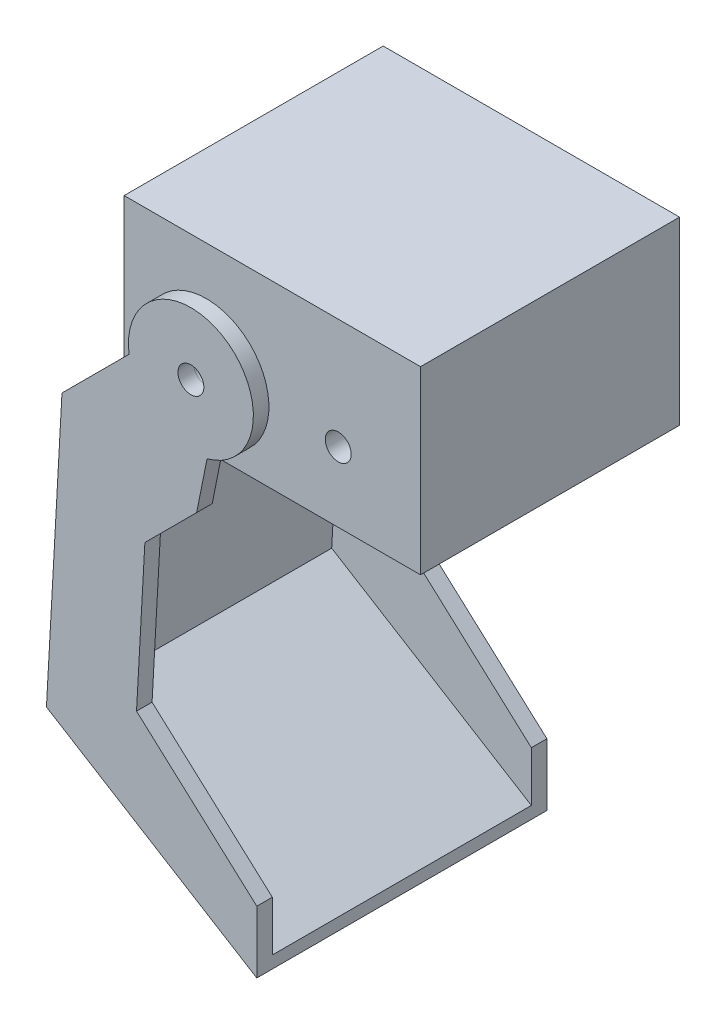
ISO-10303-21;
HEADER;
FILE_DESCRIPTION(('STEP AP214'),'2;1');
FILE_NAME('part.step','',(''),(''),'','','');
FILE_SCHEMA(('AUTOMOTIVE_DESIGN { 1 0 10303 214 1 1 1 1 }'));
ENDSEC;
DATA;
#1=APPLICATION_CONTEXT('core data for automotive mechanical design processes');
#2=APPLICATION_PROTOCOL_DEFINITION('international standard','automotive_design',2000,#1);
#3=PRODUCT_CONTEXT('',#1,'mechanical');
#4=PRODUCT('Part','Part','',(#3));
#5=PRODUCT_RELATED_PRODUCT_CATEGORY('part','',(#4));
#6=PRODUCT_DEFINITION_FORMATION('','',#4);
#7=PRODUCT_DEFINITION_CONTEXT('part definition',#1,'design');
#8=PRODUCT_DEFINITION('design','',#6,#7);
#9=PRODUCT_DEFINITION_SHAPE('','',#8);
#10=(LENGTH_UNIT() NAMED_UNIT(*) SI_UNIT(.MILLI.,.METRE.));
#11=(NAMED_UNIT(*) PLANE_ANGLE_UNIT() SI_UNIT($,.RADIAN.));
#12=(NAMED_UNIT(*) SI_UNIT($,.STERADIAN.) SOLID_ANGLE_UNIT());
#13=UNCERTAINTY_MEASURE_WITH_UNIT(LENGTH_MEASURE(1.E-05),#10,'distance_accuracy_value','');
#14=(GEOMETRIC_REPRESENTATION_CONTEXT(3) GLOBAL_UNCERTAINTY_ASSIGNED_CONTEXT((#13)) GLOBAL_UNIT_ASSIGNED_CONTEXT((#10,
#11,#12)) REPRESENTATION_CONTEXT('',''));
#15=CARTESIAN_POINT('',(0.,0.,0.));
#16=DIRECTION('',(0.,0.,1.));
#17=DIRECTION('',(1.,0.,0.));
#18=AXIS2_PLACEMENT_3D('',#15,#16,#17);
#19=CARTESIAN_POINT('',(-12.72,13.45,25.));
#20=DIRECTION('',(0.,0.,1.));
#21=DIRECTION('',(1.,0.,0.));
#22=AXIS2_PLACEMENT_3D('',#19,#20,#21);
#23=PLANE('',#22);
#24=CARTESIAN_POINT('',(-12.72,13.45,25.));
#25=DIRECTION('',(0.,0.,1.));
#26=DIRECTION('',(1.,0.,0.));
#27=AXIS2_PLACEMENT_3D('',#24,#25,#26);
#28=CIRCLE('',#27,2.5);
#29=CARTESIAN_POINT('',(-10.22,13.45,25.));
#30=VERTEX_POINT('',#29);
#31=EDGE_CURVE('E281',#30,#30,#28,.T.);
#32=ORIENTED_EDGE('',*,*,#31,.T.);
#33=EDGE_LOOP('',(#32));
#34=FACE_BOUND('',#33,.T.);
#35=DIRECTION('',(0.,1.,0.));
#36=VECTOR('',#35,1.);
#37=CARTESIAN_POINT('',(0.,-68.2,25.));
#38=LINE('',#37,#36);
#39=CARTESIAN_POINT('',(0.,-77.8513226083747,25.));
#40=VERTEX_POINT('',#39);
#41=CARTESIAN_POINT('',(0.,-68.2,25.));
#42=VERTEX_POINT('',#41);
#43=EDGE_CURVE('E310',#40,#42,#38,.T.);
#44=ORIENTED_EDGE('',*,*,#43,.F.);
#45=DIRECTION('',(0.851543088519277,-0.524284625365889,0.));
#46=VECTOR('',#45,1.);
#47=CARTESIAN_POINT('',(-38.5419985832739,-54.12148725357,25.));
#48=LINE('',#47,#46);
#49=CARTESIAN_POINT('',(-38.5419985832739,-54.12148725357,25.));
#50=VERTEX_POINT('',#49);
#51=EDGE_CURVE('E65',#50,#40,#48,.T.);
#52=ORIENTED_EDGE('',*,*,#51,.F.);
#53=DIRECTION('',(-0.0554700196225231,-0.998460353205412,0.));
#54=VECTOR('',#53,1.);
#55=CARTESIAN_POINT('',(-35.7190193328342,-3.30786074565586,25.));
#56=LINE('',#55,#54);
#57=CARTESIAN_POINT('',(-35.7190193328342,-3.30786074565586,25.));
#58=VERTEX_POINT('',#57);
#59=EDGE_CURVE('E269',#58,#50,#56,.T.);
#60=ORIENTED_EDGE('',*,*,#59,.F.);
#61=DIRECTION('',(0.666794859469826,-0.745241313525099,0.));
#62=VECTOR('',#61,1.);
#63=CARTESIAN_POINT('',(-37.605,-1.2,25.));
#64=LINE('',#63,#62);
#65=CARTESIAN_POINT('',(-37.605,-1.2,25.));
#66=VERTEX_POINT('',#65);
#67=EDGE_CURVE('E266',#66,#58,#64,.T.);
#68=ORIENTED_EDGE('',*,*,#67,.F.);
#69=DIRECTION('',(-0.707106781186547,-0.707106781186547,0.));
#70=VECTOR('',#69,1.);
#71=CARTESIAN_POINT('',(-37.605,-1.2,25.));
#72=LINE('',#71,#70);
#73=CARTESIAN_POINT('',(-24.6583545102502,11.7466454897498,25.));
#74=VERTEX_POINT('',#73);
#75=EDGE_CURVE('E285',#74,#66,#72,.T.);
#76=ORIENTED_EDGE('',*,*,#75,.F.);
#77=CARTESIAN_POINT('',(-12.72,13.45,25.));
#78=DIRECTION('',(0.,0.,1.));
#79=DIRECTION('',(1.,0.,0.));
#80=AXIS2_PLACEMENT_3D('',#77,#78,#79);
#81=CIRCLE('',#80,12.0592588909933);
#82=CARTESIAN_POINT('',(-9.60499999999999,1.8,25.));
#83=VERTEX_POINT('',#82);
#84=EDGE_CURVE('E291',#83,#74,#81,.T.);
#85=ORIENTED_EDGE('',*,*,#84,.F.);
#86=DIRECTION('',(0.196116135138184,0.98058067569092,0.));
#87=VECTOR('',#86,1.);
#88=CARTESIAN_POINT('',(-9.60499999999999,1.8,25.));
#89=LINE('',#88,#87);
#90=CARTESIAN_POINT('',(-11.605,-8.2,25.));
#91=VERTEX_POINT('',#90);
#92=EDGE_CURVE('E318',#91,#83,#89,.T.);
#93=ORIENTED_EDGE('',*,*,#92,.F.);
#94=DIRECTION('',(0.707106781186548,0.707106781186548,0.));
#95=VECTOR('',#94,1.);
#96=CARTESIAN_POINT('',(-11.605,-8.2,25.));
#97=LINE('',#96,#95);
#98=CARTESIAN_POINT('',(-21.605,-18.2,25.));
#99=VERTEX_POINT('',#98);
#100=EDGE_CURVE('E316',#99,#91,#97,.T.);
#101=ORIENTED_EDGE('',*,*,#100,.F.);
#102=DIRECTION('',(0.0554700196225228,0.998460353205412,0.));
#103=VECTOR('',#102,1.);
#104=CARTESIAN_POINT('',(-21.605,-18.2,25.));
#105=LINE('',#104,#103);
#106=CARTESIAN_POINT('',(-23.2161111111111,-47.2,25.));
#107=VERTEX_POINT('',#106);
#108=EDGE_CURVE('E314',#107,#99,#105,.T.);
#109=ORIENTED_EDGE('',*,*,#108,.F.);
#110=DIRECTION('',(-0.741616076439865,0.670824563627436,0.));
#111=VECTOR('',#110,1.);
#112=CARTESIAN_POINT('',(-23.2161111111111,-47.2,25.));
#113=LINE('',#112,#111);
#114=EDGE_CURVE('E312',#42,#107,#113,.T.);
#115=ORIENTED_EDGE('',*,*,#114,.F.);
#116=EDGE_LOOP('',(#44,#52,#60,#68,#76,#85,#93,#101,#109,#115));
#117=FACE_BOUND('',#116,.T.);
#118=ADVANCED_FACE('F50',(#34,#117),#23,.F.);
#119=CARTESIAN_POINT('',(-12.72,13.45,-25.));
#120=DIRECTION('',(0.,0.,-1.));
#121=DIRECTION('',(1.,0.,0.));
#122=AXIS2_PLACEMENT_3D('',#119,#120,#121);
#123=PLANE('',#122);
#124=CARTESIAN_POINT('',(-12.72,13.45,-25.));
#125=DIRECTION('',(0.,0.,1.));
#126=DIRECTION('',(1.,0.,0.));
#127=AXIS2_PLACEMENT_3D('',#124,#125,#126);
#128=CIRCLE('',#127,2.5);
#129=CARTESIAN_POINT('',(-10.22,13.45,-25.));
#130=VERTEX_POINT('',#129);
#131=EDGE_CURVE('E188',#130,#130,#128,.T.);
#132=ORIENTED_EDGE('',*,*,#131,.F.);
#133=EDGE_LOOP('',(#132));
#134=FACE_BOUND('',#133,.T.);
#135=DIRECTION('',(0.851543088519277,-0.524284625365889,0.));
#136=VECTOR('',#135,1.);
#137=CARTESIAN_POINT('',(-38.5419985832739,-54.12148725357,-25.));
#138=LINE('',#137,#136);
#139=CARTESIAN_POINT('',(-38.5419985832739,-54.12148725357,-25.));
#140=VERTEX_POINT('',#139);
#141=CARTESIAN_POINT('',(0.,-77.8513226083747,-25.));
#142=VERTEX_POINT('',#141);
#143=EDGE_CURVE('E179',#140,#142,#138,.T.);
#144=ORIENTED_EDGE('',*,*,#143,.T.);
#145=DIRECTION('',(0.,1.,0.));
#146=VECTOR('',#145,1.);
#147=CARTESIAN_POINT('',(0.,-68.2,-25.));
#148=LINE('',#147,#146);
#149=CARTESIAN_POINT('',(0.,-68.2,-25.));
#150=VERTEX_POINT('',#149);
#151=EDGE_CURVE('E183',#142,#150,#148,.T.);
#152=ORIENTED_EDGE('',*,*,#151,.T.);
#153=DIRECTION('',(-0.741616076439865,0.670824563627436,0.));
#154=VECTOR('',#153,1.);
#155=CARTESIAN_POINT('',(-23.2161111111111,-47.2,-25.));
#156=LINE('',#155,#154);
#157=CARTESIAN_POINT('',(-23.2161111111111,-47.2,-25.));
#158=VERTEX_POINT('',#157);
#159=EDGE_CURVE('E198',#150,#158,#156,.T.);
#160=ORIENTED_EDGE('',*,*,#159,.T.);
#161=DIRECTION('',(0.0554700196225228,0.998460353205412,0.));
#162=VECTOR('',#161,1.);
#163=CARTESIAN_POINT('',(-21.605,-18.2,-25.));
#164=LINE('',#163,#162);
#165=CARTESIAN_POINT('',(-21.605,-18.2,-25.));
#166=VERTEX_POINT('',#165);
#167=EDGE_CURVE('E220',#158,#166,#164,.T.);
#168=ORIENTED_EDGE('',*,*,#167,.T.);
#169=DIRECTION('',(0.707106781186548,0.707106781186548,0.));
#170=VECTOR('',#169,1.);
#171=CARTESIAN_POINT('',(-11.605,-8.2,-25.));
#172=LINE('',#171,#170);
#173=CARTESIAN_POINT('',(-11.605,-8.2,-25.));
#174=VERTEX_POINT('',#173);
#175=EDGE_CURVE('E217',#166,#174,#172,.T.);
#176=ORIENTED_EDGE('',*,*,#175,.T.);
#177=DIRECTION('',(0.196116135138184,0.98058067569092,0.));
#178=VECTOR('',#177,1.);
#179=CARTESIAN_POINT('',(-9.60499999999999,1.8,-25.));
#180=LINE('',#179,#178);
#181=CARTESIAN_POINT('',(-9.60499999999999,1.8,-25.));
#182=VERTEX_POINT('',#181);
#183=EDGE_CURVE('E214',#174,#182,#180,.T.);
#184=ORIENTED_EDGE('',*,*,#183,.T.);
#185=CARTESIAN_POINT('',(-12.72,13.45,-25.));
#186=DIRECTION('',(0.,0.,1.));
#187=DIRECTION('',(1.,0.,0.));
#188=AXIS2_PLACEMENT_3D('',#185,#186,#187);
#189=CIRCLE('',#188,12.0592588909933);
#190=CARTESIAN_POINT('',(-24.6583545102502,11.7466454897498,-25.));
#191=VERTEX_POINT('',#190);
#192=EDGE_CURVE('E211',#182,#191,#189,.T.);
#193=ORIENTED_EDGE('',*,*,#192,.T.);
#194=DIRECTION('',(-0.707106781186547,-0.707106781186547,0.));
#195=VECTOR('',#194,1.);
#196=CARTESIAN_POINT('',(-37.605,-1.2,-25.));
#197=LINE('',#196,#195);
#198=CARTESIAN_POINT('',(-37.605,-1.2,-25.));
#199=VERTEX_POINT('',#198);
#200=EDGE_CURVE('E208',#191,#199,#197,.T.);
#201=ORIENTED_EDGE('',*,*,#200,.T.);
#202=DIRECTION('',(0.666794859469826,-0.745241313525099,0.));
#203=VECTOR('',#202,1.);
#204=CARTESIAN_POINT('',(-37.605,-1.2,-25.));
#205=LINE('',#204,#203);
#206=CARTESIAN_POINT('',(-35.7190193328342,-3.30786074565586,-25.));
#207=VERTEX_POINT('',#206);
#208=EDGE_CURVE('E206',#199,#207,#205,.T.);
#209=ORIENTED_EDGE('',*,*,#208,.T.);
#210=DIRECTION('',(-0.0554700196225231,-0.998460353205412,0.));
#211=VECTOR('',#210,1.);
#212=CARTESIAN_POINT('',(-35.7190193328342,-3.30786074565586,-25.));
#213=LINE('',#212,#211);
#214=EDGE_CURVE('E187',#207,#140,#213,.T.);
#215=ORIENTED_EDGE('',*,*,#214,.T.);
#216=EDGE_LOOP('',(#144,#152,#160,#168,#176,#184,#193,#201,#209,#215));
#217=FACE_BOUND('',#216,.T.);
#218=ADVANCED_FACE('F181',(#134,#217),#123,.F.);
#219=CARTESIAN_POINT('',(-12.72,13.45,28.));
#220=DIRECTION('',(0.,0.,1.));
#221=DIRECTION('',(1.,0.,0.));
#222=AXIS2_PLACEMENT_3D('',#219,#220,#221);
#223=PLANE('',#222);
#224=DIRECTION('',(-0.707106781186548,-0.707106781186548,0.));
#225=VECTOR('',#224,1.);
#226=CARTESIAN_POINT('',(-28.605,7.8,28.));
#227=LINE('',#226,#225);
#228=CARTESIAN_POINT('',(-24.6583545102502,11.7466454897498,28.));
#229=VERTEX_POINT('',#228);
#230=CARTESIAN_POINT('',(-37.605,-1.2,28.));
#231=VERTEX_POINT('',#230);
#232=EDGE_CURVE('E288',#229,#231,#227,.T.);
#233=ORIENTED_EDGE('',*,*,#232,.T.);
#234=DIRECTION('',(-0.055470019622523,-0.998460353205412,0.));
#235=VECTOR('',#234,1.);
#236=CARTESIAN_POINT('',(-40.605,-55.2,28.));
#237=LINE('',#236,#235);
#238=CARTESIAN_POINT('',(-40.605,-55.2,28.));
#239=VERTEX_POINT('',#238);
#240=EDGE_CURVE('E290',#231,#239,#237,.T.);
#241=ORIENTED_EDGE('',*,*,#240,.T.);
#242=DIRECTION('',(0.851543088519277,-0.524284625365889,0.));
#243=VECTOR('',#242,1.);
#244=CARTESIAN_POINT('',(0.,-80.2,28.));
#245=LINE('',#244,#243);
#246=CARTESIAN_POINT('',(0.,-80.2,28.));
#247=VERTEX_POINT('',#246);
#248=EDGE_CURVE('E293',#239,#247,#245,.T.);
#249=ORIENTED_EDGE('',*,*,#248,.T.);
#250=DIRECTION('',(0.,1.,0.));
#251=VECTOR('',#250,1.);
#252=CARTESIAN_POINT('',(0.,-68.2,28.));
#253=LINE('',#252,#251);
#254=CARTESIAN_POINT('',(0.,-68.2,28.));
#255=VERTEX_POINT('',#254);
#256=EDGE_CURVE('E295',#247,#255,#253,.T.);
#257=ORIENTED_EDGE('',*,*,#256,.T.);
#258=DIRECTION('',(-0.741616076439865,0.670824563627436,0.));
#259=VECTOR('',#258,1.);
#260=CARTESIAN_POINT('',(-23.2161111111111,-47.2,28.));
#261=LINE('',#260,#259);
#262=CARTESIAN_POINT('',(-23.2161111111111,-47.2,28.));
#263=VERTEX_POINT('',#262);
#264=EDGE_CURVE('E297',#255,#263,#261,.T.);
#265=ORIENTED_EDGE('',*,*,#264,.T.);
#266=DIRECTION('',(0.0554700196225228,0.998460353205412,0.));
#267=VECTOR('',#266,1.);
#268=CARTESIAN_POINT('',(-21.605,-18.2,28.));
#269=LINE('',#268,#267);
#270=CARTESIAN_POINT('',(-21.605,-18.2,28.));
#271=VERTEX_POINT('',#270);
#272=EDGE_CURVE('E299',#263,#271,#269,.T.);
#273=ORIENTED_EDGE('',*,*,#272,.T.);
#274=DIRECTION('',(0.707106781186548,0.707106781186548,0.));
#275=VECTOR('',#274,1.);
#276=CARTESIAN_POINT('',(-11.605,-8.2,28.));
#277=LINE('',#276,#275);
#278=CARTESIAN_POINT('',(-11.605,-8.2,28.));
#279=VERTEX_POINT('',#278);
#280=EDGE_CURVE('E301',#271,#279,#277,.T.);
#281=ORIENTED_EDGE('',*,*,#280,.T.);
#282=DIRECTION('',(0.196116135138184,0.98058067569092,0.));
#283=VECTOR('',#282,1.);
#284=CARTESIAN_POINT('',(-9.60499999999999,1.8,28.));
#285=LINE('',#284,#283);
#286=CARTESIAN_POINT('',(-9.60499999999999,1.8,28.));
#287=VERTEX_POINT('',#286);
#288=EDGE_CURVE('E303',#279,#287,#285,.T.);
#289=ORIENTED_EDGE('',*,*,#288,.T.);
#290=CARTESIAN_POINT('',(-12.72,13.45,28.));
#291=DIRECTION('',(0.,0.,1.));
#292=DIRECTION('',(1.,0.,0.));
#293=AXIS2_PLACEMENT_3D('',#290,#291,#292);
#294=CIRCLE('',#293,12.0592588909933);
#295=EDGE_CURVE('E305',#287,#229,#294,.T.);
#296=ORIENTED_EDGE('',*,*,#295,.T.);
#297=EDGE_LOOP('',(#233,#241,#249,#257,#265,#273,#281,#289,#296));
#298=FACE_BOUND('',#297,.T.);
#299=CARTESIAN_POINT('',(-12.72,13.45,28.));
#300=DIRECTION('',(0.,0.,1.));
#301=DIRECTION('',(1.,0.,0.));
#302=AXIS2_PLACEMENT_3D('',#299,#300,#301);
#303=CIRCLE('',#302,2.5);
#304=CARTESIAN_POINT('',(-10.22,13.45,28.));
#305=VERTEX_POINT('',#304);
#306=EDGE_CURVE('E282',#305,#305,#303,.T.);
#307=ORIENTED_EDGE('',*,*,#306,.F.);
#308=EDGE_LOOP('',(#307));
#309=FACE_BOUND('',#308,.T.);
#310=ADVANCED_FACE('F361',(#298,#309),#223,.T.);
#311=CARTESIAN_POINT('',(-37.605,-1.2,28.));
#312=DIRECTION('',(0.707106781186548,-0.707106781186548,0.));
#313=DIRECTION('',(0.707106781186548,0.707106781186548,0.));
#314=AXIS2_PLACEMENT_3D('',#311,#312,#313);
#315=PLANE('',#314);
#316=ORIENTED_EDGE('',*,*,#75,.T.);
#317=DIRECTION('',(0.,0.,-1.));
#318=VECTOR('',#317,1.);
#319=CARTESIAN_POINT('',(-37.605,-1.2,28.));
#320=LINE('',#319,#318);
#321=EDGE_CURVE('E12',#231,#66,#320,.T.);
#322=ORIENTED_EDGE('',*,*,#321,.F.);
#323=ORIENTED_EDGE('',*,*,#232,.F.);
#324=DIRECTION('',(0.,0.,-1.));
#325=VECTOR('',#324,1.);
#326=CARTESIAN_POINT('',(-24.6583545102502,11.7466454897498,28.));
#327=LINE('',#326,#325);
#328=EDGE_CURVE('E307',#229,#74,#327,.T.);
#329=ORIENTED_EDGE('',*,*,#328,.T.);
#330=EDGE_LOOP('',(#316,#322,#323,#329));
#331=FACE_BOUND('',#330,.T.);
#332=ADVANCED_FACE('F52',(#331),#315,.F.);
#333=CARTESIAN_POINT('',(-40.605,-55.2,28.));
#334=DIRECTION('',(0.998460353205412,-0.055470019622523,0.));
#335=DIRECTION('',(0.055470019622523,0.998460353205413,0.));
#336=AXIS2_PLACEMENT_3D('',#333,#334,#335);
#337=PLANE('',#336);
#338=ORIENTED_EDGE('',*,*,#321,.T.);
#339=DIRECTION('',(0.,0.,1.));
#340=VECTOR('',#339,1.);
#341=CARTESIAN_POINT('',(-37.605,-1.2,-71.9292288820542));
#342=LINE('',#341,#340);
#343=EDGE_CURVE('E278',#199,#66,#342,.T.);
#344=ORIENTED_EDGE('',*,*,#343,.F.);
#345=DIRECTION('',(0.,0.,1.));
#346=VECTOR('',#345,1.);
#347=CARTESIAN_POINT('',(-37.605,-1.2,-28.));
#348=LINE('',#347,#346);
#349=CARTESIAN_POINT('',(-37.605,-1.2,-28.));
#350=VERTEX_POINT('',#349);
#351=EDGE_CURVE('E252',#350,#199,#348,.T.);
#352=ORIENTED_EDGE('',*,*,#351,.F.);
#353=DIRECTION('',(-0.055470019622523,-0.998460353205412,0.));
#354=VECTOR('',#353,1.);
#355=CARTESIAN_POINT('',(-40.605,-55.2,-28.));
#356=LINE('',#355,#354);
#357=CARTESIAN_POINT('',(-40.605,-55.2,-28.));
#358=VERTEX_POINT('',#357);
#359=EDGE_CURVE('E226',#350,#358,#356,.T.);
#360=ORIENTED_EDGE('',*,*,#359,.T.);
#361=DIRECTION('',(0.,0.,-1.));
#362=VECTOR('',#361,1.);
#363=CARTESIAN_POINT('',(-40.605,-55.2,28.));
#364=LINE('',#363,#362);
#365=EDGE_CURVE('E58',#239,#358,#364,.T.);
#366=ORIENTED_EDGE('',*,*,#365,.F.);
#367=ORIENTED_EDGE('',*,*,#240,.F.);
#368=EDGE_LOOP('',(#338,#344,#352,#360,#366,#367));
#369=FACE_BOUND('',#368,.T.);
#370=ADVANCED_FACE('F350',(#369),#337,.F.);
#371=CARTESIAN_POINT('',(0.,-80.2,28.));
#372=DIRECTION('',(0.524284625365889,0.851543088519277,0.));
#373=DIRECTION('',(-0.851543088519277,0.524284625365889,0.));
#374=AXIS2_PLACEMENT_3D('',#371,#372,#373);
#375=PLANE('',#374);
#376=DIRECTION('',(0.851543088519277,-0.524284625365889,0.));
#377=VECTOR('',#376,1.);
#378=CARTESIAN_POINT('',(0.,-80.2,-28.));
#379=LINE('',#378,#377);
#380=CARTESIAN_POINT('',(0.,-80.2,-28.));
#381=VERTEX_POINT('',#380);
#382=EDGE_CURVE('E229',#358,#381,#379,.T.);
#383=ORIENTED_EDGE('',*,*,#382,.T.);
#384=DIRECTION('',(0.,0.,-1.));
#385=VECTOR('',#384,1.);
#386=CARTESIAN_POINT('',(0.,-80.2,28.));
#387=LINE('',#386,#385);
#388=EDGE_CURVE('E339',#247,#381,#387,.T.);
#389=ORIENTED_EDGE('',*,*,#388,.F.);
#390=ORIENTED_EDGE('',*,*,#248,.F.);
#391=ORIENTED_EDGE('',*,*,#365,.T.);
#392=EDGE_LOOP('',(#383,#389,#390,#391));
#393=FACE_BOUND('',#392,.T.);
#394=ADVANCED_FACE('F343',(#393),#375,.F.);
#395=CARTESIAN_POINT('',(0.,-68.2,28.));
#396=DIRECTION('',(-1.,0.,0.));
#397=DIRECTION('',(0.,0.,1.));
#398=AXIS2_PLACEMENT_3D('',#395,#396,#397);
#399=PLANE('',#398);
#400=ORIENTED_EDGE('',*,*,#388,.T.);
#401=DIRECTION('',(0.,1.,0.));
#402=VECTOR('',#401,1.);
#403=CARTESIAN_POINT('',(0.,-68.2,-28.));
#404=LINE('',#403,#402);
#405=CARTESIAN_POINT('',(0.,-68.2,-28.));
#406=VERTEX_POINT('',#405);
#407=EDGE_CURVE('E232',#381,#406,#404,.T.);
#408=ORIENTED_EDGE('',*,*,#407,.T.);
#409=DIRECTION('',(0.,0.,1.));
#410=VECTOR('',#409,1.);
#411=CARTESIAN_POINT('',(0.,-68.2,-28.));
#412=LINE('',#411,#410);
#413=EDGE_CURVE('E195',#406,#150,#412,.T.);
#414=ORIENTED_EDGE('',*,*,#413,.T.);
#415=ORIENTED_EDGE('',*,*,#151,.F.);
#416=DIRECTION('',(0.,0.,1.));
#417=VECTOR('',#416,1.);
#418=CARTESIAN_POINT('',(0.,-77.8513226083747,-47.0064689993535));
#419=LINE('',#418,#417);
#420=EDGE_CURVE('E193',#142,#40,#419,.T.);
#421=ORIENTED_EDGE('',*,*,#420,.T.);
#422=ORIENTED_EDGE('',*,*,#43,.T.);
#423=DIRECTION('',(0.,0.,-1.));
#424=VECTOR('',#423,1.);
#425=CARTESIAN_POINT('',(0.,-68.2,28.));
#426=LINE('',#425,#424);
#427=EDGE_CURVE('E336',#255,#42,#426,.T.);
#428=ORIENTED_EDGE('',*,*,#427,.F.);
#429=ORIENTED_EDGE('',*,*,#256,.F.);
#430=EDGE_LOOP('',(#400,#408,#414,#415,#421,#422,#428,#429));
#431=FACE_BOUND('',#430,.T.);
#432=ADVANCED_FACE('F192',(#431),#399,.F.);
#433=CARTESIAN_POINT('',(-23.2161111111111,-47.2,28.));
#434=DIRECTION('',(-0.670824563627436,-0.741616076439865,0.));
#435=DIRECTION('',(0.741616076439865,-0.670824563627436,0.));
#436=AXIS2_PLACEMENT_3D('',#433,#434,#435);
#437=PLANE('',#436);
#438=ORIENTED_EDGE('',*,*,#114,.T.);
#439=DIRECTION('',(0.,0.,-1.));
#440=VECTOR('',#439,1.);
#441=CARTESIAN_POINT('',(-23.2161111111111,-47.2,28.));
#442=LINE('',#441,#440);
#443=EDGE_CURVE('E333',#263,#107,#442,.T.);
#444=ORIENTED_EDGE('',*,*,#443,.F.);
#445=ORIENTED_EDGE('',*,*,#264,.F.);
#446=ORIENTED_EDGE('',*,*,#427,.T.);
#447=EDGE_LOOP('',(#438,#444,#445,#446));
#448=FACE_BOUND('',#447,.T.);
#449=ADVANCED_FACE('F425',(#448),#437,.F.);
#450=CARTESIAN_POINT('',(-21.605,-18.2,28.));
#451=DIRECTION('',(-0.998460353205412,0.0554700196225228,0.));
#452=DIRECTION('',(-0.0554700196225228,-0.998460353205413,0.));
#453=AXIS2_PLACEMENT_3D('',#450,#451,#452);
#454=PLANE('',#453);
#455=ORIENTED_EDGE('',*,*,#108,.T.);
#456=DIRECTION('',(0.,0.,-1.));
#457=VECTOR('',#456,1.);
#458=CARTESIAN_POINT('',(-21.605,-18.2,28.));
#459=LINE('',#458,#457);
#460=EDGE_CURVE('E330',#271,#99,#459,.T.);
#461=ORIENTED_EDGE('',*,*,#460,.F.);
#462=ORIENTED_EDGE('',*,*,#272,.F.);
#463=ORIENTED_EDGE('',*,*,#443,.T.);
#464=EDGE_LOOP('',(#455,#461,#462,#463));
#465=FACE_BOUND('',#464,.T.);
#466=ADVANCED_FACE('F421',(#465),#454,.F.);
#467=CARTESIAN_POINT('',(-11.605,-8.2,28.));
#468=DIRECTION('',(-0.707106781186547,0.707106781186547,0.));
#469=DIRECTION('',(-0.707106781186548,-0.707106781186548,0.));
#470=AXIS2_PLACEMENT_3D('',#467,#468,#469);
#471=PLANE('',#470);
#472=ORIENTED_EDGE('',*,*,#100,.T.);
#473=DIRECTION('',(0.,0.,-1.));
#474=VECTOR('',#473,1.);
#475=CARTESIAN_POINT('',(-11.605,-8.2,28.));
#476=LINE('',#475,#474);
#477=EDGE_CURVE('E327',#279,#91,#476,.T.);
#478=ORIENTED_EDGE('',*,*,#477,.F.);
#479=ORIENTED_EDGE('',*,*,#280,.F.);
#480=ORIENTED_EDGE('',*,*,#460,.T.);
#481=EDGE_LOOP('',(#472,#478,#479,#480));
#482=FACE_BOUND('',#481,.T.);
#483=ADVANCED_FACE('F417',(#482),#471,.F.);
#484=CARTESIAN_POINT('',(-9.60499999999999,1.8,28.));
#485=DIRECTION('',(-0.98058067569092,0.196116135138184,0.));
#486=DIRECTION('',(-0.196116135138184,-0.98058067569092,0.));
#487=AXIS2_PLACEMENT_3D('',#484,#485,#486);
#488=PLANE('',#487);
#489=ORIENTED_EDGE('',*,*,#92,.T.);
#490=DIRECTION('',(0.,0.,-1.));
#491=VECTOR('',#490,1.);
#492=CARTESIAN_POINT('',(-9.60499999999999,1.8,28.));
#493=LINE('',#492,#491);
#494=EDGE_CURVE('E324',#287,#83,#493,.T.);
#495=ORIENTED_EDGE('',*,*,#494,.F.);
#496=ORIENTED_EDGE('',*,*,#288,.F.);
#497=ORIENTED_EDGE('',*,*,#477,.T.);
#498=EDGE_LOOP('',(#489,#495,#496,#497));
#499=FACE_BOUND('',#498,.T.);
#500=ADVANCED_FACE('F413',(#499),#488,.F.);
#501=CARTESIAN_POINT('',(-12.72,13.45,28.));
#502=DIRECTION('',(0.,0.,-1.));
#503=DIRECTION('',(-1.,0.,0.));
#504=AXIS2_PLACEMENT_3D('',#501,#502,#503);
#505=CYLINDRICAL_SURFACE('',#504,12.0592588909933);
#506=ORIENTED_EDGE('',*,*,#84,.T.);
#507=ORIENTED_EDGE('',*,*,#328,.F.);
#508=ORIENTED_EDGE('',*,*,#295,.F.);
#509=ORIENTED_EDGE('',*,*,#494,.T.);
#510=EDGE_LOOP('',(#506,#507,#508,#509));
#511=FACE_BOUND('',#510,.T.);
#512=ADVANCED_FACE('F409',(#511),#505,.T.);
#513=CARTESIAN_POINT('',(-12.72,13.45,28.));
#514=DIRECTION('',(0.,0.,-1.));
#515=DIRECTION('',(-1.,0.,0.));
#516=AXIS2_PLACEMENT_3D('',#513,#514,#515);
#517=CYLINDRICAL_SURFACE('',#516,2.5);
#518=ORIENTED_EDGE('',*,*,#306,.T.);
#519=EDGE_LOOP('',(#518));
#520=FACE_BOUND('',#519,.T.);
#521=ORIENTED_EDGE('',*,*,#31,.F.);
#522=EDGE_LOOP('',(#521));
#523=FACE_BOUND('',#522,.T.);
#524=ADVANCED_FACE('F412',(#520,#523),#517,.F.);
#525=CARTESIAN_POINT('',(-38.5419985832739,-54.12148725357,-71.9292288820542));
#526=DIRECTION('',(-0.524284625365889,-0.851543088519277,0.));
#527=DIRECTION('',(0.851543088519277,-0.524284625365889,0.));
#528=AXIS2_PLACEMENT_3D('',#525,#526,#527);
#529=PLANE('',#528);
#530=ORIENTED_EDGE('',*,*,#51,.T.);
#531=ORIENTED_EDGE('',*,*,#420,.F.);
#532=ORIENTED_EDGE('',*,*,#143,.F.);
#533=DIRECTION('',(0.,0.,1.));
#534=VECTOR('',#533,1.);
#535=CARTESIAN_POINT('',(-38.5419985832739,-54.12148725357,-71.9292288820542));
#536=LINE('',#535,#534);
#537=EDGE_CURVE('E273',#140,#50,#536,.T.);
#538=ORIENTED_EDGE('',*,*,#537,.T.);
#539=EDGE_LOOP('',(#530,#531,#532,#538));
#540=FACE_BOUND('',#539,.T.);
#541=ADVANCED_FACE('F200',(#540),#529,.F.);
#542=CARTESIAN_POINT('',(-35.7190193328342,-3.30786074565586,-71.9292288820542));
#543=DIRECTION('',(-0.998460353205412,0.0554700196225231,0.));
#544=DIRECTION('',(-0.0554700196225231,-0.998460353205413,0.));
#545=AXIS2_PLACEMENT_3D('',#542,#543,#544);
#546=PLANE('',#545);
#547=ORIENTED_EDGE('',*,*,#537,.F.);
#548=ORIENTED_EDGE('',*,*,#214,.F.);
#549=DIRECTION('',(0.,0.,1.));
#550=VECTOR('',#549,1.);
#551=CARTESIAN_POINT('',(-35.7190193328342,-3.30786074565586,-71.9292288820542));
#552=LINE('',#551,#550);
#553=EDGE_CURVE('E275',#207,#58,#552,.T.);
#554=ORIENTED_EDGE('',*,*,#553,.T.);
#555=ORIENTED_EDGE('',*,*,#59,.T.);
#556=EDGE_LOOP('',(#547,#548,#554,#555));
#557=FACE_BOUND('',#556,.T.);
#558=ADVANCED_FACE('F454',(#557),#546,.F.);
#559=CARTESIAN_POINT('',(-37.605,-1.2,-71.9292288820542));
#560=DIRECTION('',(-0.745241313525099,-0.666794859469826,0.));
#561=DIRECTION('',(0.666794859469826,-0.745241313525099,0.));
#562=AXIS2_PLACEMENT_3D('',#559,#560,#561);
#563=PLANE('',#562);
#564=ORIENTED_EDGE('',*,*,#553,.F.);
#565=ORIENTED_EDGE('',*,*,#208,.F.);
#566=ORIENTED_EDGE('',*,*,#343,.T.);
#567=ORIENTED_EDGE('',*,*,#67,.T.);
#568=EDGE_LOOP('',(#564,#565,#566,#567));
#569=FACE_BOUND('',#568,.T.);
#570=ADVANCED_FACE('F369',(#569),#563,.F.);
#571=CARTESIAN_POINT('',(-12.72,13.45,-28.));
#572=DIRECTION('',(0.,0.,-1.));
#573=DIRECTION('',(1.,0.,0.));
#574=AXIS2_PLACEMENT_3D('',#571,#572,#573);
#575=PLANE('',#574);
#576=DIRECTION('',(-0.707106781186548,-0.707106781186548,0.));
#577=VECTOR('',#576,1.);
#578=CARTESIAN_POINT('',(-28.605,7.8,-28.));
#579=LINE('',#578,#577);
#580=CARTESIAN_POINT('',(-24.6583545102502,11.7466454897498,-28.));
#581=VERTEX_POINT('',#580);
#582=EDGE_CURVE('E197',#581,#350,#579,.T.);
#583=ORIENTED_EDGE('',*,*,#582,.F.);
#584=CARTESIAN_POINT('',(-12.72,13.45,-28.));
#585=DIRECTION('',(0.,0.,1.));
#586=DIRECTION('',(1.,0.,0.));
#587=AXIS2_PLACEMENT_3D('',#584,#585,#586);
#588=CIRCLE('',#587,12.0592588909933);
#589=CARTESIAN_POINT('',(-9.60499999999999,1.8,-28.));
#590=VERTEX_POINT('',#589);
#591=EDGE_CURVE('E246',#590,#581,#588,.T.);
#592=ORIENTED_EDGE('',*,*,#591,.F.);
#593=DIRECTION('',(0.196116135138184,0.98058067569092,0.));
#594=VECTOR('',#593,1.);
#595=CARTESIAN_POINT('',(-9.60499999999999,1.8,-28.));
#596=LINE('',#595,#594);
#597=CARTESIAN_POINT('',(-11.605,-8.2,-28.));
#598=VERTEX_POINT('',#597);
#599=EDGE_CURVE('E243',#598,#590,#596,.T.);
#600=ORIENTED_EDGE('',*,*,#599,.F.);
#601=DIRECTION('',(0.707106781186548,0.707106781186548,0.));
#602=VECTOR('',#601,1.);
#603=CARTESIAN_POINT('',(-11.605,-8.2,-28.));
#604=LINE('',#603,#602);
#605=CARTESIAN_POINT('',(-21.605,-18.2,-28.));
#606=VERTEX_POINT('',#605);
#607=EDGE_CURVE('E240',#606,#598,#604,.T.);
#608=ORIENTED_EDGE('',*,*,#607,.F.);
#609=DIRECTION('',(0.0554700196225228,0.998460353205412,0.));
#610=VECTOR('',#609,1.);
#611=CARTESIAN_POINT('',(-21.605,-18.2,-28.));
#612=LINE('',#611,#610);
#613=CARTESIAN_POINT('',(-23.2161111111111,-47.2,-28.));
#614=VERTEX_POINT('',#613);
#615=EDGE_CURVE('E237',#614,#606,#612,.T.);
#616=ORIENTED_EDGE('',*,*,#615,.F.);
#617=DIRECTION('',(-0.741616076439865,0.670824563627436,0.));
#618=VECTOR('',#617,1.);
#619=CARTESIAN_POINT('',(-23.2161111111111,-47.2,-28.));
#620=LINE('',#619,#618);
#621=EDGE_CURVE('E234',#406,#614,#620,.T.);
#622=ORIENTED_EDGE('',*,*,#621,.F.);
#623=ORIENTED_EDGE('',*,*,#407,.F.);
#624=ORIENTED_EDGE('',*,*,#382,.F.);
#625=ORIENTED_EDGE('',*,*,#359,.F.);
#626=EDGE_LOOP('',(#583,#592,#600,#608,#616,#622,#623,#624,#625));
#627=FACE_BOUND('',#626,.T.);
#628=CARTESIAN_POINT('',(-12.72,13.45,-28.));
#629=DIRECTION('',(0.,0.,1.));
#630=DIRECTION('',(1.,0.,0.));
#631=AXIS2_PLACEMENT_3D('',#628,#629,#630);
#632=CIRCLE('',#631,2.5);
#633=CARTESIAN_POINT('',(-10.22,13.45,-28.));
#634=VERTEX_POINT('',#633);
#635=EDGE_CURVE('E249',#634,#634,#632,.T.);
#636=ORIENTED_EDGE('',*,*,#635,.T.);
#637=EDGE_LOOP('',(#636));
#638=FACE_BOUND('',#637,.T.);
#639=ADVANCED_FACE('F353',(#627,#638),#575,.T.);
#640=CARTESIAN_POINT('',(-37.605,-1.2,-28.));
#641=DIRECTION('',(0.707106781186548,-0.707106781186548,0.));
#642=DIRECTION('',(0.707106781186548,0.707106781186548,0.));
#643=AXIS2_PLACEMENT_3D('',#640,#641,#642);
#644=PLANE('',#643);
#645=ORIENTED_EDGE('',*,*,#200,.F.);
#646=DIRECTION('',(0.,0.,1.));
#647=VECTOR('',#646,1.);
#648=CARTESIAN_POINT('',(-24.6583545102502,11.7466454897498,-28.));
#649=LINE('',#648,#647);
#650=EDGE_CURVE('E255',#581,#191,#649,.T.);
#651=ORIENTED_EDGE('',*,*,#650,.F.);
#652=ORIENTED_EDGE('',*,*,#582,.T.);
#653=ORIENTED_EDGE('',*,*,#351,.T.);
#654=EDGE_LOOP('',(#645,#651,#652,#653));
#655=FACE_BOUND('',#654,.T.);
#656=ADVANCED_FACE('F373',(#655),#644,.F.);
#657=CARTESIAN_POINT('',(-23.2161111111111,-47.2,-28.));
#658=DIRECTION('',(-0.670824563627436,-0.741616076439865,0.));
#659=DIRECTION('',(0.741616076439865,-0.670824563627436,0.));
#660=AXIS2_PLACEMENT_3D('',#657,#658,#659);
#661=PLANE('',#660);
#662=ORIENTED_EDGE('',*,*,#159,.F.);
#663=ORIENTED_EDGE('',*,*,#413,.F.);
#664=ORIENTED_EDGE('',*,*,#621,.T.);
#665=DIRECTION('',(0.,0.,1.));
#666=VECTOR('',#665,1.);
#667=CARTESIAN_POINT('',(-23.2161111111111,-47.2,-28.));
#668=LINE('',#667,#666);
#669=EDGE_CURVE('E258',#614,#158,#668,.T.);
#670=ORIENTED_EDGE('',*,*,#669,.T.);
#671=EDGE_LOOP('',(#662,#663,#664,#670));
#672=FACE_BOUND('',#671,.T.);
#673=ADVANCED_FACE('F389',(#672),#661,.F.);
#674=CARTESIAN_POINT('',(-21.605,-18.2,-28.));
#675=DIRECTION('',(-0.998460353205412,0.0554700196225228,0.));
#676=DIRECTION('',(-0.0554700196225228,-0.998460353205413,0.));
#677=AXIS2_PLACEMENT_3D('',#674,#675,#676);
#678=PLANE('',#677);
#679=ORIENTED_EDGE('',*,*,#167,.F.);
#680=ORIENTED_EDGE('',*,*,#669,.F.);
#681=ORIENTED_EDGE('',*,*,#615,.T.);
#682=DIRECTION('',(0.,0.,1.));
#683=VECTOR('',#682,1.);
#684=CARTESIAN_POINT('',(-21.605,-18.2,-28.));
#685=LINE('',#684,#683);
#686=EDGE_CURVE('E260',#606,#166,#685,.T.);
#687=ORIENTED_EDGE('',*,*,#686,.T.);
#688=EDGE_LOOP('',(#679,#680,#681,#687));
#689=FACE_BOUND('',#688,.T.);
#690=ADVANCED_FACE('F387',(#689),#678,.F.);
#691=CARTESIAN_POINT('',(-11.605,-8.2,-28.));
#692=DIRECTION('',(-0.707106781186547,0.707106781186547,0.));
#693=DIRECTION('',(-0.707106781186548,-0.707106781186548,0.));
#694=AXIS2_PLACEMENT_3D('',#691,#692,#693);
#695=PLANE('',#694);
#696=ORIENTED_EDGE('',*,*,#175,.F.);
#697=ORIENTED_EDGE('',*,*,#686,.F.);
#698=ORIENTED_EDGE('',*,*,#607,.T.);
#699=DIRECTION('',(0.,0.,1.));
#700=VECTOR('',#699,1.);
#701=CARTESIAN_POINT('',(-11.605,-8.2,-28.));
#702=LINE('',#701,#700);
#703=EDGE_CURVE('E262',#598,#174,#702,.T.);
#704=ORIENTED_EDGE('',*,*,#703,.T.);
#705=EDGE_LOOP('',(#696,#697,#698,#704));
#706=FACE_BOUND('',#705,.T.);
#707=ADVANCED_FACE('F384',(#706),#695,.F.);
#708=CARTESIAN_POINT('',(-9.60499999999999,1.8,-28.));
#709=DIRECTION('',(-0.98058067569092,0.196116135138184,0.));
#710=DIRECTION('',(-0.196116135138184,-0.98058067569092,0.));
#711=AXIS2_PLACEMENT_3D('',#708,#709,#710);
#712=PLANE('',#711);
#713=ORIENTED_EDGE('',*,*,#183,.F.);
#714=ORIENTED_EDGE('',*,*,#703,.F.);
#715=ORIENTED_EDGE('',*,*,#599,.T.);
#716=DIRECTION('',(0.,0.,1.));
#717=VECTOR('',#716,1.);
#718=CARTESIAN_POINT('',(-9.60499999999999,1.8,-28.));
#719=LINE('',#718,#717);
#720=EDGE_CURVE('E264',#590,#182,#719,.T.);
#721=ORIENTED_EDGE('',*,*,#720,.T.);
#722=EDGE_LOOP('',(#713,#714,#715,#721));
#723=FACE_BOUND('',#722,.T.);
#724=ADVANCED_FACE('F381',(#723),#712,.F.);
#725=CARTESIAN_POINT('',(-12.72,13.45,-28.));
#726=DIRECTION('',(0.,0.,1.));
#727=DIRECTION('',(-1.,0.,0.));
#728=AXIS2_PLACEMENT_3D('',#725,#726,#727);
#729=CYLINDRICAL_SURFACE('',#728,12.0592588909933);
#730=ORIENTED_EDGE('',*,*,#192,.F.);
#731=ORIENTED_EDGE('',*,*,#720,.F.);
#732=ORIENTED_EDGE('',*,*,#591,.T.);
#733=ORIENTED_EDGE('',*,*,#650,.T.);
#734=EDGE_LOOP('',(#730,#731,#732,#733));
#735=FACE_BOUND('',#734,.T.);
#736=ADVANCED_FACE('F378',(#735),#729,.T.);
#737=CARTESIAN_POINT('',(-12.72,13.45,-28.));
#738=DIRECTION('',(0.,0.,1.));
#739=DIRECTION('',(-1.,0.,0.));
#740=AXIS2_PLACEMENT_3D('',#737,#738,#739);
#741=CYLINDRICAL_SURFACE('',#740,2.5);
#742=ORIENTED_EDGE('',*,*,#635,.F.);
#743=EDGE_LOOP('',(#742));
#744=FACE_BOUND('',#743,.T.);
#745=ORIENTED_EDGE('',*,*,#131,.T.);
#746=EDGE_LOOP('',(#745));
#747=FACE_BOUND('',#746,.T.);
#748=ADVANCED_FACE('F508',(#744,#747),#741,.F.);
#749=CLOSED_SHELL('',(#118,#218,#310,#332,#370,#394,#432,#449,#466,#483,#500,#512,#524,#541,
#558,#570,#639,#656,#673,#690,#707,#724,#736,#748));
#750=MANIFOLD_SOLID_BREP('B2',#749);
#751=CARTESIAN_POINT('',(28.605,34.8,25.));
#752=DIRECTION('',(-1.,0.,0.));
#753=DIRECTION('',(0.,0.,1.));
#754=AXIS2_PLACEMENT_3D('',#751,#752,#753);
#755=PLANE('',#754);
#756=DIRECTION('',(0.,0.,-1.));
#757=VECTOR('',#756,1.);
#758=CARTESIAN_POINT('',(28.605,0.,25.));
#759=LINE('',#758,#757);
#760=CARTESIAN_POINT('',(28.605,0.,25.));
#761=VERTEX_POINT('',#760);
#762=CARTESIAN_POINT('',(28.605,0.,-25.));
#763=VERTEX_POINT('',#762);
#764=EDGE_CURVE('E707',#761,#763,#759,.T.);
#765=ORIENTED_EDGE('',*,*,#764,.T.);
#766=DIRECTION('',(0.,-1.,0.));
#767=VECTOR('',#766,1.);
#768=CARTESIAN_POINT('',(28.605,34.8,-25.));
#769=LINE('',#768,#767);
#770=CARTESIAN_POINT('',(28.605,34.8,-25.));
#771=VERTEX_POINT('',#770);
#772=EDGE_CURVE('E48',#771,#763,#769,.T.);
#773=ORIENTED_EDGE('',*,*,#772,.F.);
#774=DIRECTION('',(0.,0.,-1.));
#775=VECTOR('',#774,1.);
#776=CARTESIAN_POINT('',(28.605,34.8,25.));
#777=LINE('',#776,#775);
#778=CARTESIAN_POINT('',(28.605,34.8,25.));
#779=VERTEX_POINT('',#778);
#780=EDGE_CURVE('E695',#779,#771,#777,.T.);
#781=ORIENTED_EDGE('',*,*,#780,.F.);
#782=DIRECTION('',(0.,-1.,0.));
#783=VECTOR('',#782,1.);
#784=CARTESIAN_POINT('',(28.605,34.8,25.));
#785=LINE('',#784,#783);
#786=EDGE_CURVE('E703',#779,#761,#785,.T.);
#787=ORIENTED_EDGE('',*,*,#786,.T.);
#788=EDGE_LOOP('',(#765,#773,#781,#787));
#789=FACE_BOUND('',#788,.T.);
#790=ADVANCED_FACE('F644',(#789),#755,.F.);
#791=CARTESIAN_POINT('',(-28.605,34.8,-25.));
#792=DIRECTION('',(0.,0.,1.));
#793=DIRECTION('',(1.,0.,0.));
#794=AXIS2_PLACEMENT_3D('',#791,#792,#793);
#795=PLANE('',#794);
#796=CARTESIAN_POINT('',(12.72,13.45,-25.));
#797=DIRECTION('',(0.,0.,-1.));
#798=DIRECTION('',(-1.,0.,0.));
#799=AXIS2_PLACEMENT_3D('',#796,#797,#798);
#800=CIRCLE('',#799,2.5);
#801=CARTESIAN_POINT('',(10.22,13.45,-25.));
#802=VERTEX_POINT('',#801);
#803=EDGE_CURVE('E724',#802,#802,#800,.T.);
#804=ORIENTED_EDGE('',*,*,#803,.F.);
#805=EDGE_LOOP('',(#804));
#806=FACE_BOUND('',#805,.T.);
#807=CARTESIAN_POINT('',(-12.72,13.45,-25.));
#808=DIRECTION('',(0.,0.,1.));
#809=DIRECTION('',(1.,0.,0.));
#810=AXIS2_PLACEMENT_3D('',#807,#808,#809);
#811=CIRCLE('',#810,2.5);
#812=CARTESIAN_POINT('',(-10.22,13.45,-25.));
#813=VERTEX_POINT('',#812);
#814=EDGE_CURVE('E710',#813,#813,#811,.T.);
#815=ORIENTED_EDGE('',*,*,#814,.T.);
#816=EDGE_LOOP('',(#815));
#817=FACE_BOUND('',#816,.T.);
#818=DIRECTION('',(-1.,0.,0.));
#819=VECTOR('',#818,1.);
#820=CARTESIAN_POINT('',(-28.605,0.,-25.));
#821=LINE('',#820,#819);
#822=CARTESIAN_POINT('',(-28.605,0.,-25.));
#823=VERTEX_POINT('',#822);
#824=EDGE_CURVE('E699',#763,#823,#821,.T.);
#825=ORIENTED_EDGE('',*,*,#824,.T.);
#826=DIRECTION('',(0.,-1.,0.));
#827=VECTOR('',#826,1.);
#828=CARTESIAN_POINT('',(-28.605,34.8,-25.));
#829=LINE('',#828,#827);
#830=CARTESIAN_POINT('',(-28.605,34.8,-25.));
#831=VERTEX_POINT('',#830);
#832=EDGE_CURVE('E652',#831,#823,#829,.T.);
#833=ORIENTED_EDGE('',*,*,#832,.F.);
#834=DIRECTION('',(-1.,0.,0.));
#835=VECTOR('',#834,1.);
#836=CARTESIAN_POINT('',(-28.605,34.8,-25.));
#837=LINE('',#836,#835);
#838=EDGE_CURVE('E690',#771,#831,#837,.T.);
#839=ORIENTED_EDGE('',*,*,#838,.F.);
#840=ORIENTED_EDGE('',*,*,#772,.T.);
#841=EDGE_LOOP('',(#825,#833,#839,#840));
#842=FACE_BOUND('',#841,.T.);
#843=ADVANCED_FACE('F698',(#806,#817,#842),#795,.F.);
#844=CARTESIAN_POINT('',(-28.605,34.8,25.));
#845=DIRECTION('',(1.,0.,0.));
#846=DIRECTION('',(0.,0.,-1.));
#847=AXIS2_PLACEMENT_3D('',#844,#845,#846);
#848=PLANE('',#847);
#849=DIRECTION('',(0.,0.,1.));
#850=VECTOR('',#849,1.);
#851=CARTESIAN_POINT('',(-28.605,0.,25.));
#852=LINE('',#851,#850);
#853=CARTESIAN_POINT('',(-28.605,0.,25.));
#854=VERTEX_POINT('',#853);
#855=EDGE_CURVE('E677',#823,#854,#852,.T.);
#856=ORIENTED_EDGE('',*,*,#855,.T.);
#857=DIRECTION('',(0.,-1.,0.));
#858=VECTOR('',#857,1.);
#859=CARTESIAN_POINT('',(-28.605,34.8,25.));
#860=LINE('',#859,#858);
#861=CARTESIAN_POINT('',(-28.605,34.8,25.));
#862=VERTEX_POINT('',#861);
#863=EDGE_CURVE('E700',#862,#854,#860,.T.);
#864=ORIENTED_EDGE('',*,*,#863,.F.);
#865=DIRECTION('',(0.,0.,1.));
#866=VECTOR('',#865,1.);
#867=CARTESIAN_POINT('',(-28.605,34.8,25.));
#868=LINE('',#867,#866);
#869=EDGE_CURVE('E693',#831,#862,#868,.T.);
#870=ORIENTED_EDGE('',*,*,#869,.F.);
#871=ORIENTED_EDGE('',*,*,#832,.T.);
#872=EDGE_LOOP('',(#856,#864,#870,#871));
#873=FACE_BOUND('',#872,.T.);
#874=ADVANCED_FACE('F701',(#873),#848,.F.);
#875=CARTESIAN_POINT('',(-28.605,34.8,25.));
#876=DIRECTION('',(0.,0.,-1.));
#877=DIRECTION('',(-1.,0.,0.));
#878=AXIS2_PLACEMENT_3D('',#875,#876,#877);
#879=PLANE('',#878);
#880=CARTESIAN_POINT('',(12.72,13.45,25.));
#881=DIRECTION('',(0.,0.,-1.));
#882=DIRECTION('',(-1.,0.,0.));
#883=AXIS2_PLACEMENT_3D('',#880,#881,#882);
#884=CIRCLE('',#883,2.5);
#885=CARTESIAN_POINT('',(10.22,13.45,25.));
#886=VERTEX_POINT('',#885);
#887=EDGE_CURVE('E727',#886,#886,#884,.T.);
#888=ORIENTED_EDGE('',*,*,#887,.T.);
#889=EDGE_LOOP('',(#888));
#890=FACE_BOUND('',#889,.T.);
#891=CARTESIAN_POINT('',(-12.72,13.45,25.));
#892=DIRECTION('',(0.,0.,1.));
#893=DIRECTION('',(1.,0.,0.));
#894=AXIS2_PLACEMENT_3D('',#891,#892,#893);
#895=CIRCLE('',#894,2.5);
#896=CARTESIAN_POINT('',(-10.22,13.45,25.));
#897=VERTEX_POINT('',#896);
#898=EDGE_CURVE('E721',#897,#897,#895,.T.);
#899=ORIENTED_EDGE('',*,*,#898,.F.);
#900=EDGE_LOOP('',(#899));
#901=FACE_BOUND('',#900,.T.);
#902=DIRECTION('',(1.,0.,0.));
#903=VECTOR('',#902,1.);
#904=CARTESIAN_POINT('',(-28.605,0.,25.));
#905=LINE('',#904,#903);
#906=EDGE_CURVE('E683',#854,#761,#905,.T.);
#907=ORIENTED_EDGE('',*,*,#906,.T.);
#908=ORIENTED_EDGE('',*,*,#786,.F.);
#909=DIRECTION('',(1.,0.,0.));
#910=VECTOR('',#909,1.);
#911=CARTESIAN_POINT('',(-28.605,34.8,25.));
#912=LINE('',#911,#910);
#913=EDGE_CURVE('E660',#862,#779,#912,.T.);
#914=ORIENTED_EDGE('',*,*,#913,.F.);
#915=ORIENTED_EDGE('',*,*,#863,.T.);
#916=EDGE_LOOP('',(#907,#908,#914,#915));
#917=FACE_BOUND('',#916,.T.);
#918=ADVANCED_FACE('F715',(#890,#901,#917),#879,.F.);
#919=CARTESIAN_POINT('',(0.,34.8,0.));
#920=DIRECTION('',(0.,-1.,0.));
#921=DIRECTION('',(0.,0.,-1.));
#922=AXIS2_PLACEMENT_3D('',#919,#920,#921);
#923=PLANE('',#922);
#924=ORIENTED_EDGE('',*,*,#780,.T.);
#925=ORIENTED_EDGE('',*,*,#838,.T.);
#926=ORIENTED_EDGE('',*,*,#869,.T.);
#927=ORIENTED_EDGE('',*,*,#913,.T.);
#928=EDGE_LOOP('',(#924,#925,#926,#927));
#929=FACE_BOUND('',#928,.T.);
#930=ADVANCED_FACE('F691',(#929),#923,.F.);
#931=CARTESIAN_POINT('',(0.,0.,0.));
#932=DIRECTION('',(0.,-1.,0.));
#933=DIRECTION('',(0.,0.,-1.));
#934=AXIS2_PLACEMENT_3D('',#931,#932,#933);
#935=PLANE('',#934);
#936=ORIENTED_EDGE('',*,*,#764,.F.);
#937=ORIENTED_EDGE('',*,*,#906,.F.);
#938=ORIENTED_EDGE('',*,*,#855,.F.);
#939=ORIENTED_EDGE('',*,*,#824,.F.);
#940=EDGE_LOOP('',(#936,#937,#938,#939));
#941=FACE_BOUND('',#940,.T.);
#942=ADVANCED_FACE('F718',(#941),#935,.T.);
#943=CARTESIAN_POINT('',(-12.72,13.45,-25.));
#944=DIRECTION('',(0.,0.,1.));
#945=DIRECTION('',(1.,0.,0.));
#946=AXIS2_PLACEMENT_3D('',#943,#944,#945);
#947=CYLINDRICAL_SURFACE('',#946,2.5);
#948=ORIENTED_EDGE('',*,*,#814,.F.);
#949=EDGE_LOOP('',(#948));
#950=FACE_BOUND('',#949,.T.);
#951=ORIENTED_EDGE('',*,*,#898,.T.);
#952=EDGE_LOOP('',(#951));
#953=FACE_BOUND('',#952,.T.);
#954=ADVANCED_FACE('F740',(#950,#953),#947,.F.);
#955=CARTESIAN_POINT('',(12.72,13.45,-25.));
#956=DIRECTION('',(0.,0.,1.));
#957=DIRECTION('',(1.,0.,0.));
#958=AXIS2_PLACEMENT_3D('',#955,#956,#957);
#959=CYLINDRICAL_SURFACE('',#958,2.5);
#960=ORIENTED_EDGE('',*,*,#803,.T.);
#961=EDGE_LOOP('',(#960));
#962=FACE_BOUND('',#961,.T.);
#963=ORIENTED_EDGE('',*,*,#887,.F.);
#964=EDGE_LOOP('',(#963));
#965=FACE_BOUND('',#964,.T.);
#966=ADVANCED_FACE('F733',(#962,#965),#959,.F.);
#967=CLOSED_SHELL('',(#790,#843,#874,#918,#930,#942,#954,#966));
#968=MANIFOLD_SOLID_BREP('B6_NOT_SHOWN',#967);
#969=ADVANCED_BREP_SHAPE_REPRESENTATION('',(#18,#750,#968),#14);
#970=SHAPE_DEFINITION_REPRESENTATION(#9,#969);
ENDSEC;
END-ISO-10303-21;
